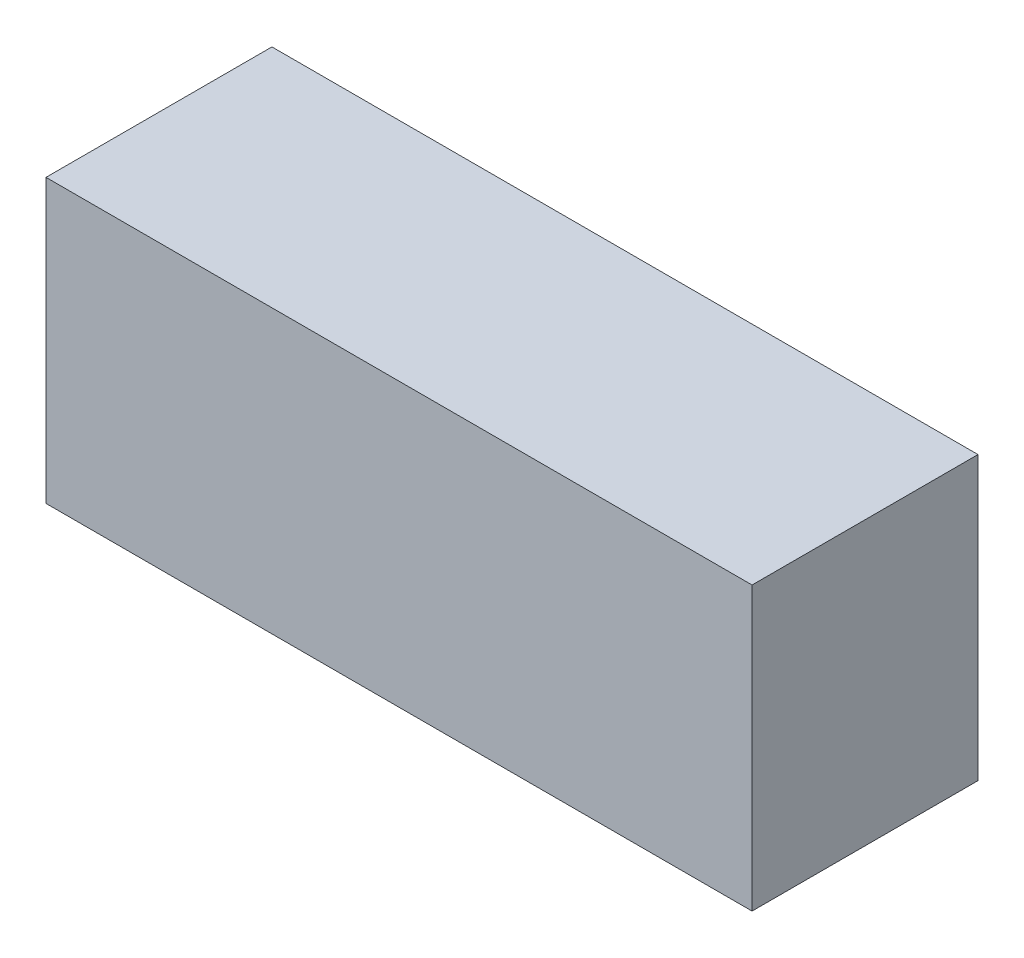
ISO-10303-21;
HEADER;
FILE_DESCRIPTION(('STEP AP214'),'2;1');
FILE_NAME('part.step','',(''),(''),'','','');
FILE_SCHEMA(('AUTOMOTIVE_DESIGN { 1 0 10303 214 1 1 1 1 }'));
ENDSEC;
DATA;
#1=APPLICATION_CONTEXT('core data for automotive mechanical design processes');
#2=APPLICATION_PROTOCOL_DEFINITION('international standard','automotive_design',2000,#1);
#3=PRODUCT_CONTEXT('',#1,'mechanical');
#4=PRODUCT('Part','Part','',(#3));
#5=PRODUCT_RELATED_PRODUCT_CATEGORY('part','',(#4));
#6=PRODUCT_DEFINITION_FORMATION('','',#4);
#7=PRODUCT_DEFINITION_CONTEXT('part definition',#1,'design');
#8=PRODUCT_DEFINITION('design','',#6,#7);
#9=PRODUCT_DEFINITION_SHAPE('','',#8);
#10=(LENGTH_UNIT() NAMED_UNIT(*) SI_UNIT(.MILLI.,.METRE.));
#11=(NAMED_UNIT(*) PLANE_ANGLE_UNIT() SI_UNIT($,.RADIAN.));
#12=(NAMED_UNIT(*) SI_UNIT($,.STERADIAN.) SOLID_ANGLE_UNIT());
#13=UNCERTAINTY_MEASURE_WITH_UNIT(LENGTH_MEASURE(1.E-05),#10,'distance_accuracy_value','');
#14=(GEOMETRIC_REPRESENTATION_CONTEXT(3) GLOBAL_UNCERTAINTY_ASSIGNED_CONTEXT((#13)) GLOBAL_UNIT_ASSIGNED_CONTEXT((#10,
#11,#12)) REPRESENTATION_CONTEXT('',''));
#15=CARTESIAN_POINT('',(0.,0.,0.));
#16=DIRECTION('',(0.,0.,1.));
#17=DIRECTION('',(1.,0.,0.));
#18=AXIS2_PLACEMENT_3D('',#15,#16,#17);
#19=CARTESIAN_POINT('',(-50.,-20.,32.));
#20=DIRECTION('',(-1.,0.,0.));
#21=DIRECTION('',(0.,0.,1.));
#22=AXIS2_PLACEMENT_3D('',#19,#20,#21);
#23=PLANE('',#22);
#24=DIRECTION('',(0.,1.,0.));
#25=VECTOR('',#24,1.);
#26=CARTESIAN_POINT('',(-50.,-20.,0.));
#27=LINE('',#26,#25);
#28=CARTESIAN_POINT('',(-50.,-20.,0.));
#29=VERTEX_POINT('',#28);
#30=CARTESIAN_POINT('',(-50.,20.,0.));
#31=VERTEX_POINT('',#30);
#32=EDGE_CURVE('E98',#29,#31,#27,.T.);
#33=ORIENTED_EDGE('',*,*,#32,.F.);
#34=DIRECTION('',(0.,0.,-1.));
#35=VECTOR('',#34,1.);
#36=CARTESIAN_POINT('',(-50.,-20.,32.));
#37=LINE('',#36,#35);
#38=CARTESIAN_POINT('',(-50.,-20.,32.));
#39=VERTEX_POINT('',#38);
#40=EDGE_CURVE('E11',#39,#29,#37,.T.);
#41=ORIENTED_EDGE('',*,*,#40,.F.);
#42=DIRECTION('',(0.,1.,0.));
#43=VECTOR('',#42,1.);
#44=CARTESIAN_POINT('',(-50.,-20.,32.));
#45=LINE('',#44,#43);
#46=CARTESIAN_POINT('',(-50.,20.,32.));
#47=VERTEX_POINT('',#46);
#48=EDGE_CURVE('E93',#39,#47,#45,.T.);
#49=ORIENTED_EDGE('',*,*,#48,.T.);
#50=DIRECTION('',(0.,0.,-1.));
#51=VECTOR('',#50,1.);
#52=CARTESIAN_POINT('',(-50.,20.,32.));
#53=LINE('',#52,#51);
#54=EDGE_CURVE('E36',#47,#31,#53,.T.);
#55=ORIENTED_EDGE('',*,*,#54,.T.);
#56=EDGE_LOOP('',(#33,#41,#49,#55));
#57=FACE_BOUND('',#56,.T.);
#58=ADVANCED_FACE('F33',(#57),#23,.T.);
#59=CARTESIAN_POINT('',(-50.,-20.,32.));
#60=DIRECTION('',(0.,1.,0.));
#61=DIRECTION('',(0.,0.,1.));
#62=AXIS2_PLACEMENT_3D('',#59,#60,#61);
#63=PLANE('',#62);
#64=DIRECTION('',(1.,0.,0.));
#65=VECTOR('',#64,1.);
#66=CARTESIAN_POINT('',(-50.,-20.,0.));
#67=LINE('',#66,#65);
#68=CARTESIAN_POINT('',(50.,-20.,0.));
#69=VERTEX_POINT('',#68);
#70=EDGE_CURVE('E66',#29,#69,#67,.T.);
#71=ORIENTED_EDGE('',*,*,#70,.T.);
#72=DIRECTION('',(0.,0.,-1.));
#73=VECTOR('',#72,1.);
#74=CARTESIAN_POINT('',(50.,-20.,32.));
#75=LINE('',#74,#73);
#76=CARTESIAN_POINT('',(50.,-20.,32.));
#77=VERTEX_POINT('',#76);
#78=EDGE_CURVE('E42',#77,#69,#75,.T.);
#79=ORIENTED_EDGE('',*,*,#78,.F.);
#80=DIRECTION('',(1.,0.,0.));
#81=VECTOR('',#80,1.);
#82=CARTESIAN_POINT('',(-50.,-20.,32.));
#83=LINE('',#82,#81);
#84=EDGE_CURVE('E83',#39,#77,#83,.T.);
#85=ORIENTED_EDGE('',*,*,#84,.F.);
#86=ORIENTED_EDGE('',*,*,#40,.T.);
#87=EDGE_LOOP('',(#71,#79,#85,#86));
#88=FACE_BOUND('',#87,.T.);
#89=ADVANCED_FACE('F108',(#88),#63,.F.);
#90=CARTESIAN_POINT('',(50.,-20.,32.));
#91=DIRECTION('',(-1.,0.,0.));
#92=DIRECTION('',(0.,0.,1.));
#93=AXIS2_PLACEMENT_3D('',#90,#91,#92);
#94=PLANE('',#93);
#95=DIRECTION('',(0.,1.,0.));
#96=VECTOR('',#95,1.);
#97=CARTESIAN_POINT('',(50.,-20.,0.));
#98=LINE('',#97,#96);
#99=CARTESIAN_POINT('',(50.,20.,0.));
#100=VERTEX_POINT('',#99);
#101=EDGE_CURVE('E90',#69,#100,#98,.T.);
#102=ORIENTED_EDGE('',*,*,#101,.T.);
#103=DIRECTION('',(0.,0.,-1.));
#104=VECTOR('',#103,1.);
#105=CARTESIAN_POINT('',(50.,20.,32.));
#106=LINE('',#105,#104);
#107=CARTESIAN_POINT('',(50.,20.,32.));
#108=VERTEX_POINT('',#107);
#109=EDGE_CURVE('E87',#108,#100,#106,.T.);
#110=ORIENTED_EDGE('',*,*,#109,.F.);
#111=DIRECTION('',(0.,1.,0.));
#112=VECTOR('',#111,1.);
#113=CARTESIAN_POINT('',(50.,-20.,32.));
#114=LINE('',#113,#112);
#115=EDGE_CURVE('E78',#77,#108,#114,.T.);
#116=ORIENTED_EDGE('',*,*,#115,.F.);
#117=ORIENTED_EDGE('',*,*,#78,.T.);
#118=EDGE_LOOP('',(#102,#110,#116,#117));
#119=FACE_BOUND('',#118,.T.);
#120=ADVANCED_FACE('F88',(#119),#94,.F.);
#121=CARTESIAN_POINT('',(-50.,20.,32.));
#122=DIRECTION('',(0.,1.,0.));
#123=DIRECTION('',(0.,0.,1.));
#124=AXIS2_PLACEMENT_3D('',#121,#122,#123);
#125=PLANE('',#124);
#126=DIRECTION('',(1.,0.,0.));
#127=VECTOR('',#126,1.);
#128=CARTESIAN_POINT('',(-50.,20.,0.));
#129=LINE('',#128,#127);
#130=EDGE_CURVE('E101',#31,#100,#129,.T.);
#131=ORIENTED_EDGE('',*,*,#130,.F.);
#132=ORIENTED_EDGE('',*,*,#54,.F.);
#133=DIRECTION('',(1.,0.,0.));
#134=VECTOR('',#133,1.);
#135=CARTESIAN_POINT('',(-50.,20.,32.));
#136=LINE('',#135,#134);
#137=EDGE_CURVE('E82',#47,#108,#136,.T.);
#138=ORIENTED_EDGE('',*,*,#137,.T.);
#139=ORIENTED_EDGE('',*,*,#109,.T.);
#140=EDGE_LOOP('',(#131,#132,#138,#139));
#141=FACE_BOUND('',#140,.T.);
#142=ADVANCED_FACE('F92',(#141),#125,.T.);
#143=CARTESIAN_POINT('',(0.,0.,32.));
#144=DIRECTION('',(0.,0.,-1.));
#145=DIRECTION('',(-1.,0.,0.));
#146=AXIS2_PLACEMENT_3D('',#143,#144,#145);
#147=PLANE('',#146);
#148=ORIENTED_EDGE('',*,*,#48,.F.);
#149=ORIENTED_EDGE('',*,*,#84,.T.);
#150=ORIENTED_EDGE('',*,*,#115,.T.);
#151=ORIENTED_EDGE('',*,*,#137,.F.);
#152=EDGE_LOOP('',(#148,#149,#150,#151));
#153=FACE_BOUND('',#152,.T.);
#154=ADVANCED_FACE('F81',(#153),#147,.F.);
#155=CARTESIAN_POINT('',(0.,0.,0.));
#156=DIRECTION('',(0.,0.,-1.));
#157=DIRECTION('',(-1.,0.,0.));
#158=AXIS2_PLACEMENT_3D('',#155,#156,#157);
#159=PLANE('',#158);
#160=ORIENTED_EDGE('',*,*,#32,.T.);
#161=ORIENTED_EDGE('',*,*,#130,.T.);
#162=ORIENTED_EDGE('',*,*,#101,.F.);
#163=ORIENTED_EDGE('',*,*,#70,.F.);
#164=EDGE_LOOP('',(#160,#161,#162,#163));
#165=FACE_BOUND('',#164,.T.);
#166=ADVANCED_FACE('F106',(#165),#159,.T.);
#167=CLOSED_SHELL('',(#58,#89,#120,#142,#154,#166));
#168=MANIFOLD_SOLID_BREP('B2',#167);
#169=ADVANCED_BREP_SHAPE_REPRESENTATION('',(#18,#168),#14);
#170=SHAPE_DEFINITION_REPRESENTATION(#9,#169);
ENDSEC;
END-ISO-10303-21;
